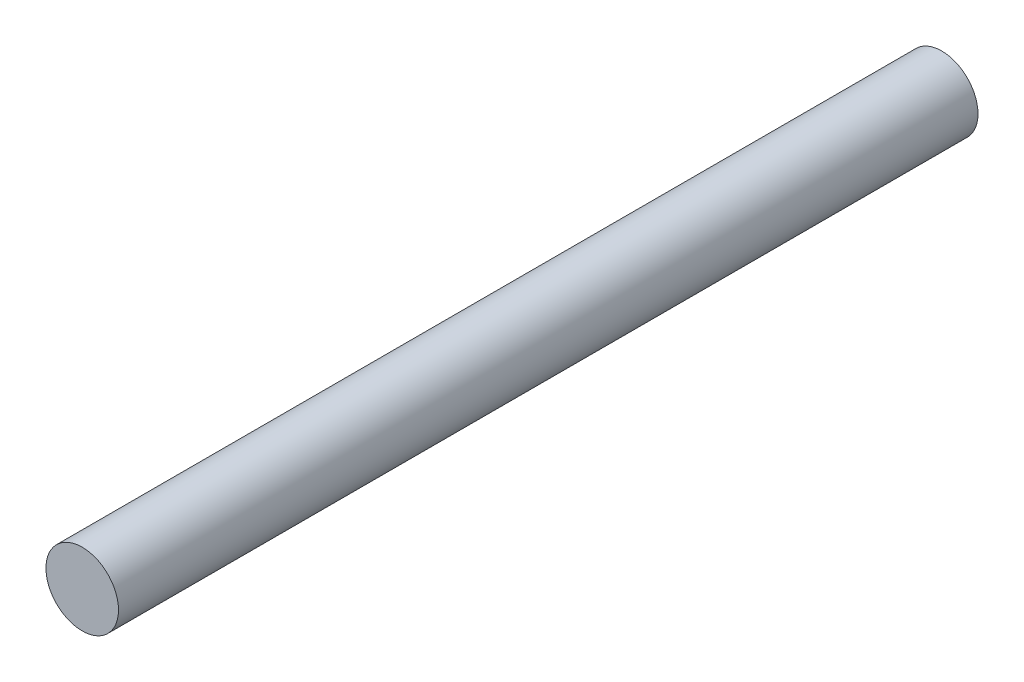
ISO-10303-21;
HEADER;
FILE_DESCRIPTION(('STEP AP214'),'2;1');
FILE_NAME('part.step','',(''),(''),'','','');
FILE_SCHEMA(('AUTOMOTIVE_DESIGN { 1 0 10303 214 1 1 1 1 }'));
ENDSEC;
DATA;
#1=APPLICATION_CONTEXT('core data for automotive mechanical design processes');
#2=APPLICATION_PROTOCOL_DEFINITION('international standard','automotive_design',2000,#1);
#3=PRODUCT_CONTEXT('',#1,'mechanical');
#4=PRODUCT('Part','Part','',(#3));
#5=PRODUCT_RELATED_PRODUCT_CATEGORY('part','',(#4));
#6=PRODUCT_DEFINITION_FORMATION('','',#4);
#7=PRODUCT_DEFINITION_CONTEXT('part definition',#1,'design');
#8=PRODUCT_DEFINITION('design','',#6,#7);
#9=PRODUCT_DEFINITION_SHAPE('','',#8);
#10=(LENGTH_UNIT() NAMED_UNIT(*) SI_UNIT(.MILLI.,.METRE.));
#11=(NAMED_UNIT(*) PLANE_ANGLE_UNIT() SI_UNIT($,.RADIAN.));
#12=(NAMED_UNIT(*) SI_UNIT($,.STERADIAN.) SOLID_ANGLE_UNIT());
#13=UNCERTAINTY_MEASURE_WITH_UNIT(LENGTH_MEASURE(1.E-05),#10,'distance_accuracy_value','');
#14=(GEOMETRIC_REPRESENTATION_CONTEXT(3) GLOBAL_UNCERTAINTY_ASSIGNED_CONTEXT((#13)) GLOBAL_UNIT_ASSIGNED_CONTEXT((#10,
#11,#12)) REPRESENTATION_CONTEXT('',''));
#15=CARTESIAN_POINT('',(0.,0.,0.));
#16=DIRECTION('',(0.,0.,1.));
#17=DIRECTION('',(1.,0.,0.));
#18=AXIS2_PLACEMENT_3D('',#15,#16,#17);
#19=CARTESIAN_POINT('',(0.,0.,90.));
#20=DIRECTION('',(0.,0.,-1.));
#21=DIRECTION('',(-1.,0.,0.));
#22=AXIS2_PLACEMENT_3D('',#19,#20,#21);
#23=CYLINDRICAL_SURFACE('',#22,3.8);
#24=CARTESIAN_POINT('',(0.,0.,90.));
#25=DIRECTION('',(0.,0.,1.));
#26=DIRECTION('',(1.,0.,0.));
#27=AXIS2_PLACEMENT_3D('',#24,#25,#26);
#28=CIRCLE('',#27,3.8);
#29=CARTESIAN_POINT('',(3.8,0.,90.));
#30=VERTEX_POINT('',#29);
#31=EDGE_CURVE('E10',#30,#30,#28,.T.);
#32=ORIENTED_EDGE('',*,*,#31,.F.);
#33=EDGE_LOOP('',(#32));
#34=FACE_BOUND('',#33,.T.);
#35=CARTESIAN_POINT('',(0.,0.,0.));
#36=DIRECTION('',(0.,0.,1.));
#37=DIRECTION('',(1.,0.,0.));
#38=AXIS2_PLACEMENT_3D('',#35,#36,#37);
#39=CIRCLE('',#38,3.8);
#40=CARTESIAN_POINT('',(3.8,0.,0.));
#41=VERTEX_POINT('',#40);
#42=EDGE_CURVE('E36',#41,#41,#39,.T.);
#43=ORIENTED_EDGE('',*,*,#42,.T.);
#44=EDGE_LOOP('',(#43));
#45=FACE_BOUND('',#44,.T.);
#46=ADVANCED_FACE('F33',(#34,#45),#23,.T.);
#47=CARTESIAN_POINT('',(0.,0.,90.));
#48=DIRECTION('',(0.,0.,1.));
#49=DIRECTION('',(1.,0.,0.));
#50=AXIS2_PLACEMENT_3D('',#47,#48,#49);
#51=PLANE('',#50);
#52=ORIENTED_EDGE('',*,*,#31,.T.);
#53=EDGE_LOOP('',(#52));
#54=FACE_BOUND('',#53,.T.);
#55=ADVANCED_FACE('F48',(#54),#51,.T.);
#56=CARTESIAN_POINT('',(0.,0.,0.));
#57=DIRECTION('',(0.,0.,1.));
#58=DIRECTION('',(1.,0.,0.));
#59=AXIS2_PLACEMENT_3D('',#56,#57,#58);
#60=PLANE('',#59);
#61=ORIENTED_EDGE('',*,*,#42,.F.);
#62=EDGE_LOOP('',(#61));
#63=FACE_BOUND('',#62,.T.);
#64=ADVANCED_FACE('F46',(#63),#60,.F.);
#65=CLOSED_SHELL('',(#46,#55,#64));
#66=MANIFOLD_SOLID_BREP('B2',#65);
#67=ADVANCED_BREP_SHAPE_REPRESENTATION('',(#18,#66),#14);
#68=SHAPE_DEFINITION_REPRESENTATION(#9,#67);
ENDSEC;
END-ISO-10303-21;
